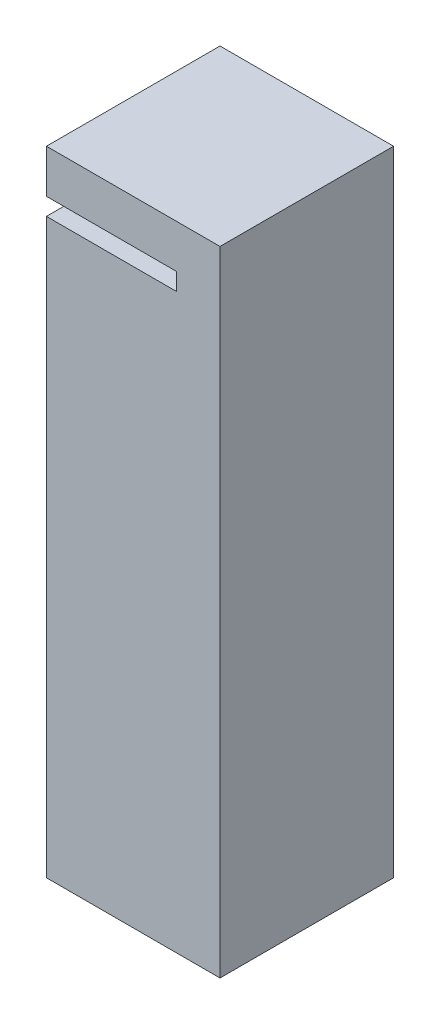
ISO-10303-21;
HEADER;
FILE_DESCRIPTION(('STEP AP214'),'2;1');
FILE_NAME('part.step','',(''),(''),'','','');
FILE_SCHEMA(('AUTOMOTIVE_DESIGN { 1 0 10303 214 1 1 1 1 }'));
ENDSEC;
DATA;
#1=APPLICATION_CONTEXT('core data for automotive mechanical design processes');
#2=APPLICATION_PROTOCOL_DEFINITION('international standard','automotive_design',2000,#1);
#3=PRODUCT_CONTEXT('',#1,'mechanical');
#4=PRODUCT('Part','Part','',(#3));
#5=PRODUCT_RELATED_PRODUCT_CATEGORY('part','',(#4));
#6=PRODUCT_DEFINITION_FORMATION('','',#4);
#7=PRODUCT_DEFINITION_CONTEXT('part definition',#1,'design');
#8=PRODUCT_DEFINITION('design','',#6,#7);
#9=PRODUCT_DEFINITION_SHAPE('','',#8);
#10=(LENGTH_UNIT() NAMED_UNIT(*) SI_UNIT(.MILLI.,.METRE.));
#11=(NAMED_UNIT(*) PLANE_ANGLE_UNIT() SI_UNIT($,.RADIAN.));
#12=(NAMED_UNIT(*) SI_UNIT($,.STERADIAN.) SOLID_ANGLE_UNIT());
#13=UNCERTAINTY_MEASURE_WITH_UNIT(LENGTH_MEASURE(1.E-05),#10,'distance_accuracy_value','');
#14=(GEOMETRIC_REPRESENTATION_CONTEXT(3) GLOBAL_UNCERTAINTY_ASSIGNED_CONTEXT((#13)) GLOBAL_UNIT_ASSIGNED_CONTEXT((#10,
#11,#12)) REPRESENTATION_CONTEXT('',''));
#15=CARTESIAN_POINT('',(0.,0.,0.));
#16=DIRECTION('',(0.,0.,1.));
#17=DIRECTION('',(1.,0.,0.));
#18=AXIS2_PLACEMENT_3D('',#15,#16,#17);
#19=CARTESIAN_POINT('',(0.,10.,0.));
#20=DIRECTION('',(1.,0.,0.));
#21=DIRECTION('',(0.,0.,-1.));
#22=AXIS2_PLACEMENT_3D('',#19,#20,#21);
#23=PLANE('',#22);
#24=DIRECTION('',(0.,0.,1.));
#25=VECTOR('',#24,1.);
#26=CARTESIAN_POINT('',(0.,136.,-31.6227766016838));
#27=LINE('',#26,#25);
#28=CARTESIAN_POINT('',(0.,136.,0.));
#29=VERTEX_POINT('',#28);
#30=CARTESIAN_POINT('',(0.,136.,40.));
#31=VERTEX_POINT('',#30);
#32=EDGE_CURVE('E179',#29,#31,#27,.T.);
#33=ORIENTED_EDGE('',*,*,#32,.T.);
#34=DIRECTION('',(0.,-1.,0.));
#35=VECTOR('',#34,1.);
#36=CARTESIAN_POINT('',(0.,10.,40.));
#37=LINE('',#36,#35);
#38=CARTESIAN_POINT('',(0.,146.,40.));
#39=VERTEX_POINT('',#38);
#40=EDGE_CURVE('E11',#39,#31,#37,.T.);
#41=ORIENTED_EDGE('',*,*,#40,.F.);
#42=DIRECTION('',(0.,0.,1.));
#43=VECTOR('',#42,1.);
#44=CARTESIAN_POINT('',(0.,146.,30.));
#45=LINE('',#44,#43);
#46=CARTESIAN_POINT('',(0.,146.,0.));
#47=VERTEX_POINT('',#46);
#48=EDGE_CURVE('E208',#47,#39,#45,.T.);
#49=ORIENTED_EDGE('',*,*,#48,.F.);
#50=DIRECTION('',(0.,-1.,0.));
#51=VECTOR('',#50,1.);
#52=CARTESIAN_POINT('',(0.,136.,0.));
#53=LINE('',#52,#51);
#54=EDGE_CURVE('E190',#47,#29,#53,.T.);
#55=ORIENTED_EDGE('',*,*,#54,.T.);
#56=EDGE_LOOP('',(#33,#41,#49,#55));
#57=FACE_BOUND('',#56,.T.);
#58=ADVANCED_FACE('F43',(#57),#23,.F.);
#59=CARTESIAN_POINT('',(30.,146.,0.));
#60=DIRECTION('',(1.,0.,0.));
#61=DIRECTION('',(0.,0.,-1.));
#62=AXIS2_PLACEMENT_3D('',#59,#60,#61);
#63=PLANE('',#62);
#64=DIRECTION('',(0.,0.,1.));
#65=VECTOR('',#64,1.);
#66=CARTESIAN_POINT('',(30.,132.,-31.6227766016838));
#67=LINE('',#66,#65);
#68=CARTESIAN_POINT('',(30.,132.,0.));
#69=VERTEX_POINT('',#68);
#70=CARTESIAN_POINT('',(30.,132.,40.));
#71=VERTEX_POINT('',#70);
#72=EDGE_CURVE('E132',#69,#71,#67,.T.);
#73=ORIENTED_EDGE('',*,*,#72,.T.);
#74=DIRECTION('',(0.,-1.,0.));
#75=VECTOR('',#74,1.);
#76=CARTESIAN_POINT('',(30.,136.,40.));
#77=LINE('',#76,#75);
#78=CARTESIAN_POINT('',(30.,136.,40.));
#79=VERTEX_POINT('',#78);
#80=EDGE_CURVE('E137',#79,#71,#77,.T.);
#81=ORIENTED_EDGE('',*,*,#80,.F.);
#82=DIRECTION('',(0.,0.,1.));
#83=VECTOR('',#82,1.);
#84=CARTESIAN_POINT('',(30.,136.,-31.6227766016838));
#85=LINE('',#84,#83);
#86=CARTESIAN_POINT('',(30.,136.,0.));
#87=VERTEX_POINT('',#86);
#88=EDGE_CURVE('E193',#87,#79,#85,.T.);
#89=ORIENTED_EDGE('',*,*,#88,.F.);
#90=DIRECTION('',(0.,-1.,0.));
#91=VECTOR('',#90,1.);
#92=CARTESIAN_POINT('',(30.,146.,0.));
#93=LINE('',#92,#91);
#94=EDGE_CURVE('E140',#87,#69,#93,.T.);
#95=ORIENTED_EDGE('',*,*,#94,.T.);
#96=EDGE_LOOP('',(#73,#81,#89,#95));
#97=FACE_BOUND('',#96,.T.);
#98=ADVANCED_FACE('F134',(#97),#63,.F.);
#99=DIRECTION('',(0.,0.,1.));
#100=VECTOR('',#99,1.);
#101=CARTESIAN_POINT('',(30.,122.,-31.6227766016838));
#102=LINE('',#101,#100);
#103=CARTESIAN_POINT('',(30.,122.,0.));
#104=VERTEX_POINT('',#103);
#105=CARTESIAN_POINT('',(30.,122.,30.));
#106=VERTEX_POINT('',#105);
#107=EDGE_CURVE('E167',#104,#106,#102,.T.);
#108=ORIENTED_EDGE('',*,*,#107,.F.);
#109=CARTESIAN_POINT('',(30.,10.,0.));
#110=VERTEX_POINT('',#109);
#111=EDGE_CURVE('E226',#104,#110,#93,.T.);
#112=ORIENTED_EDGE('',*,*,#111,.T.);
#113=DIRECTION('',(0.,0.,1.));
#114=VECTOR('',#113,1.);
#115=CARTESIAN_POINT('',(30.,10.,0.));
#116=LINE('',#115,#114);
#117=CARTESIAN_POINT('',(30.,10.,30.));
#118=VERTEX_POINT('',#117);
#119=EDGE_CURVE('E189',#110,#118,#116,.T.);
#120=ORIENTED_EDGE('',*,*,#119,.T.);
#121=DIRECTION('',(0.,-1.,0.));
#122=VECTOR('',#121,1.);
#123=CARTESIAN_POINT('',(30.,146.,30.));
#124=LINE('',#123,#122);
#125=EDGE_CURVE('E223',#106,#118,#124,.T.);
#126=ORIENTED_EDGE('',*,*,#125,.F.);
#127=EDGE_LOOP('',(#108,#112,#120,#126));
#128=FACE_BOUND('',#127,.T.);
#129=ADVANCED_FACE('F289',(#128),#63,.F.);
#130=CARTESIAN_POINT('',(30.,146.,30.));
#131=DIRECTION('',(0.,0.,1.));
#132=DIRECTION('',(1.,0.,0.));
#133=AXIS2_PLACEMENT_3D('',#130,#131,#132);
#134=PLANE('',#133);
#135=DIRECTION('',(-1.,0.,0.));
#136=VECTOR('',#135,1.);
#137=CARTESIAN_POINT('',(0.,122.,30.));
#138=LINE('',#137,#136);
#139=CARTESIAN_POINT('',(0.,122.,30.));
#140=VERTEX_POINT('',#139);
#141=EDGE_CURVE('E59',#106,#140,#138,.T.);
#142=ORIENTED_EDGE('',*,*,#141,.F.);
#143=ORIENTED_EDGE('',*,*,#125,.T.);
#144=DIRECTION('',(-1.,0.,0.));
#145=VECTOR('',#144,1.);
#146=CARTESIAN_POINT('',(30.,10.,30.));
#147=LINE('',#146,#145);
#148=CARTESIAN_POINT('',(0.,10.,30.));
#149=VERTEX_POINT('',#148);
#150=EDGE_CURVE('E204',#118,#149,#147,.T.);
#151=ORIENTED_EDGE('',*,*,#150,.T.);
#152=DIRECTION('',(0.,-1.,0.));
#153=VECTOR('',#152,1.);
#154=CARTESIAN_POINT('',(0.,146.,30.));
#155=LINE('',#154,#153);
#156=EDGE_CURVE('E64',#140,#149,#155,.T.);
#157=ORIENTED_EDGE('',*,*,#156,.F.);
#158=EDGE_LOOP('',(#142,#143,#151,#157));
#159=FACE_BOUND('',#158,.T.);
#160=ADVANCED_FACE('F292',(#159),#134,.F.);
#161=CARTESIAN_POINT('',(0.,132.,40.));
#162=VERTEX_POINT('',#161);
#163=CARTESIAN_POINT('',(0.,0.,40.));
#164=VERTEX_POINT('',#163);
#165=EDGE_CURVE('E52',#162,#164,#37,.T.);
#166=ORIENTED_EDGE('',*,*,#165,.F.);
#167=DIRECTION('',(0.,0.,1.));
#168=VECTOR('',#167,1.);
#169=CARTESIAN_POINT('',(0.,132.,-31.6227766016838));
#170=LINE('',#169,#168);
#171=CARTESIAN_POINT('',(0.,132.,0.));
#172=VERTEX_POINT('',#171);
#173=EDGE_CURVE('E145',#172,#162,#170,.T.);
#174=ORIENTED_EDGE('',*,*,#173,.F.);
#175=DIRECTION('',(0.,-1.,0.));
#176=VECTOR('',#175,1.);
#177=CARTESIAN_POINT('',(0.,132.,0.));
#178=LINE('',#177,#176);
#179=CARTESIAN_POINT('',(0.,122.,0.));
#180=VERTEX_POINT('',#179);
#181=EDGE_CURVE('E168',#172,#180,#178,.T.);
#182=ORIENTED_EDGE('',*,*,#181,.T.);
#183=DIRECTION('',(0.,0.,1.));
#184=VECTOR('',#183,1.);
#185=CARTESIAN_POINT('',(0.,122.,-31.6227766016838));
#186=LINE('',#185,#184);
#187=EDGE_CURVE('E172',#180,#140,#186,.T.);
#188=ORIENTED_EDGE('',*,*,#187,.T.);
#189=ORIENTED_EDGE('',*,*,#156,.T.);
#190=DIRECTION('',(0.,0.,1.));
#191=VECTOR('',#190,1.);
#192=CARTESIAN_POINT('',(0.,10.,0.));
#193=LINE('',#192,#191);
#194=CARTESIAN_POINT('',(0.,10.,0.));
#195=VERTEX_POINT('',#194);
#196=EDGE_CURVE('E230',#195,#149,#193,.T.);
#197=ORIENTED_EDGE('',*,*,#196,.F.);
#198=DIRECTION('',(0.,-1.,0.));
#199=VECTOR('',#198,1.);
#200=CARTESIAN_POINT('',(0.,10.,0.));
#201=LINE('',#200,#199);
#202=CARTESIAN_POINT('',(0.,0.,0.));
#203=VERTEX_POINT('',#202);
#204=EDGE_CURVE('E238',#195,#203,#201,.T.);
#205=ORIENTED_EDGE('',*,*,#204,.T.);
#206=DIRECTION('',(0.,0.,1.));
#207=VECTOR('',#206,1.);
#208=CARTESIAN_POINT('',(0.,0.,0.));
#209=LINE('',#208,#207);
#210=EDGE_CURVE('E229',#203,#164,#209,.T.);
#211=ORIENTED_EDGE('',*,*,#210,.T.);
#212=EDGE_LOOP('',(#166,#174,#182,#188,#189,#197,#205,#211));
#213=FACE_BOUND('',#212,.T.);
#214=ADVANCED_FACE('F45',(#213),#23,.F.);
#215=CARTESIAN_POINT('',(0.,10.,40.));
#216=DIRECTION('',(0.,0.,-1.));
#217=DIRECTION('',(-1.,0.,0.));
#218=AXIS2_PLACEMENT_3D('',#215,#216,#217);
#219=PLANE('',#218);
#220=ORIENTED_EDGE('',*,*,#40,.T.);
#221=DIRECTION('',(1.,0.,0.));
#222=VECTOR('',#221,1.);
#223=CARTESIAN_POINT('',(30.,136.,40.));
#224=LINE('',#223,#222);
#225=EDGE_CURVE('E154',#31,#79,#224,.T.);
#226=ORIENTED_EDGE('',*,*,#225,.T.);
#227=ORIENTED_EDGE('',*,*,#80,.T.);
#228=DIRECTION('',(-1.,0.,0.));
#229=VECTOR('',#228,1.);
#230=CARTESIAN_POINT('',(30.,132.,40.));
#231=LINE('',#230,#229);
#232=EDGE_CURVE('E148',#71,#162,#231,.T.);
#233=ORIENTED_EDGE('',*,*,#232,.T.);
#234=ORIENTED_EDGE('',*,*,#165,.T.);
#235=DIRECTION('',(1.,0.,0.));
#236=VECTOR('',#235,1.);
#237=CARTESIAN_POINT('',(0.,0.,40.));
#238=LINE('',#237,#236);
#239=CARTESIAN_POINT('',(40.,0.,40.));
#240=VERTEX_POINT('',#239);
#241=EDGE_CURVE('E242',#164,#240,#238,.T.);
#242=ORIENTED_EDGE('',*,*,#241,.T.);
#243=DIRECTION('',(0.,-1.,0.));
#244=VECTOR('',#243,1.);
#245=CARTESIAN_POINT('',(40.,10.,40.));
#246=LINE('',#245,#244);
#247=CARTESIAN_POINT('',(40.,146.,40.));
#248=VERTEX_POINT('',#247);
#249=EDGE_CURVE('E256',#248,#240,#246,.T.);
#250=ORIENTED_EDGE('',*,*,#249,.F.);
#251=DIRECTION('',(1.,0.,0.));
#252=VECTOR('',#251,1.);
#253=CARTESIAN_POINT('',(0.,146.,40.));
#254=LINE('',#253,#252);
#255=EDGE_CURVE('E212',#39,#248,#254,.T.);
#256=ORIENTED_EDGE('',*,*,#255,.F.);
#257=EDGE_LOOP('',(#220,#226,#227,#233,#234,#242,#250,#256));
#258=FACE_BOUND('',#257,.T.);
#259=ADVANCED_FACE('F156',(#258),#219,.F.);
#260=CARTESIAN_POINT('',(40.,10.,0.));
#261=DIRECTION('',(-1.,0.,0.));
#262=DIRECTION('',(0.,0.,1.));
#263=AXIS2_PLACEMENT_3D('',#260,#261,#262);
#264=PLANE('',#263);
#265=DIRECTION('',(0.,0.,-1.));
#266=VECTOR('',#265,1.);
#267=CARTESIAN_POINT('',(40.,0.,0.));
#268=LINE('',#267,#266);
#269=CARTESIAN_POINT('',(40.,0.,0.));
#270=VERTEX_POINT('',#269);
#271=EDGE_CURVE('E245',#240,#270,#268,.T.);
#272=ORIENTED_EDGE('',*,*,#271,.T.);
#273=DIRECTION('',(0.,-1.,0.));
#274=VECTOR('',#273,1.);
#275=CARTESIAN_POINT('',(40.,10.,0.));
#276=LINE('',#275,#274);
#277=CARTESIAN_POINT('',(40.,146.,0.));
#278=VERTEX_POINT('',#277);
#279=EDGE_CURVE('E253',#278,#270,#276,.T.);
#280=ORIENTED_EDGE('',*,*,#279,.F.);
#281=DIRECTION('',(0.,0.,-1.));
#282=VECTOR('',#281,1.);
#283=CARTESIAN_POINT('',(40.,146.,40.));
#284=LINE('',#283,#282);
#285=EDGE_CURVE('E199',#248,#278,#284,.T.);
#286=ORIENTED_EDGE('',*,*,#285,.F.);
#287=ORIENTED_EDGE('',*,*,#249,.T.);
#288=EDGE_LOOP('',(#272,#280,#286,#287));
#289=FACE_BOUND('',#288,.T.);
#290=ADVANCED_FACE('F276',(#289),#264,.F.);
#291=CARTESIAN_POINT('',(0.,10.,0.));
#292=DIRECTION('',(0.,0.,1.));
#293=DIRECTION('',(1.,0.,0.));
#294=AXIS2_PLACEMENT_3D('',#291,#292,#293);
#295=PLANE('',#294);
#296=DIRECTION('',(-1.,0.,0.));
#297=VECTOR('',#296,1.);
#298=CARTESIAN_POINT('',(0.,0.,0.));
#299=LINE('',#298,#297);
#300=EDGE_CURVE('E235',#270,#203,#299,.T.);
#301=ORIENTED_EDGE('',*,*,#300,.T.);
#302=ORIENTED_EDGE('',*,*,#204,.F.);
#303=DIRECTION('',(-1.,0.,0.));
#304=VECTOR('',#303,1.);
#305=CARTESIAN_POINT('',(0.,10.,0.));
#306=LINE('',#305,#304);
#307=EDGE_CURVE('E234',#110,#195,#306,.T.);
#308=ORIENTED_EDGE('',*,*,#307,.F.);
#309=ORIENTED_EDGE('',*,*,#111,.F.);
#310=DIRECTION('',(1.,0.,0.));
#311=VECTOR('',#310,1.);
#312=CARTESIAN_POINT('',(0.,122.,0.));
#313=LINE('',#312,#311);
#314=EDGE_CURVE('E163',#180,#104,#313,.T.);
#315=ORIENTED_EDGE('',*,*,#314,.F.);
#316=ORIENTED_EDGE('',*,*,#181,.F.);
#317=DIRECTION('',(-1.,0.,0.));
#318=VECTOR('',#317,1.);
#319=CARTESIAN_POINT('',(30.,132.,0.));
#320=LINE('',#319,#318);
#321=EDGE_CURVE('E164',#69,#172,#320,.T.);
#322=ORIENTED_EDGE('',*,*,#321,.F.);
#323=ORIENTED_EDGE('',*,*,#94,.F.);
#324=DIRECTION('',(1.,0.,0.));
#325=VECTOR('',#324,1.);
#326=CARTESIAN_POINT('',(30.,136.,0.));
#327=LINE('',#326,#325);
#328=EDGE_CURVE('E186',#29,#87,#327,.T.);
#329=ORIENTED_EDGE('',*,*,#328,.F.);
#330=ORIENTED_EDGE('',*,*,#54,.F.);
#331=DIRECTION('',(-1.,0.,0.));
#332=VECTOR('',#331,1.);
#333=CARTESIAN_POINT('',(40.,146.,0.));
#334=LINE('',#333,#332);
#335=EDGE_CURVE('E203',#278,#47,#334,.T.);
#336=ORIENTED_EDGE('',*,*,#335,.F.);
#337=ORIENTED_EDGE('',*,*,#279,.T.);
#338=EDGE_LOOP('',(#301,#302,#308,#309,#315,#316,#322,#323,#329,#330,#336,#337));
#339=FACE_BOUND('',#338,.T.);
#340=ADVANCED_FACE('F273',(#339),#295,.F.);
#341=CARTESIAN_POINT('',(0.,10.,0.));
#342=DIRECTION('',(0.,1.,0.));
#343=DIRECTION('',(0.,0.,1.));
#344=AXIS2_PLACEMENT_3D('',#341,#342,#343);
#345=PLANE('',#344);
#346=ORIENTED_EDGE('',*,*,#150,.F.);
#347=ORIENTED_EDGE('',*,*,#119,.F.);
#348=ORIENTED_EDGE('',*,*,#307,.T.);
#349=ORIENTED_EDGE('',*,*,#196,.T.);
#350=EDGE_LOOP('',(#346,#347,#348,#349));
#351=FACE_BOUND('',#350,.T.);
#352=ADVANCED_FACE('F294',(#351),#345,.T.);
#353=CARTESIAN_POINT('',(0.,0.,0.));
#354=DIRECTION('',(0.,1.,0.));
#355=DIRECTION('',(0.,0.,1.));
#356=AXIS2_PLACEMENT_3D('',#353,#354,#355);
#357=PLANE('',#356);
#358=ORIENTED_EDGE('',*,*,#210,.F.);
#359=ORIENTED_EDGE('',*,*,#300,.F.);
#360=ORIENTED_EDGE('',*,*,#271,.F.);
#361=ORIENTED_EDGE('',*,*,#241,.F.);
#362=EDGE_LOOP('',(#358,#359,#360,#361));
#363=FACE_BOUND('',#362,.T.);
#364=ADVANCED_FACE('F267',(#363),#357,.F.);
#365=CARTESIAN_POINT('',(0.,146.,0.));
#366=DIRECTION('',(0.,1.,0.));
#367=DIRECTION('',(0.,0.,1.));
#368=AXIS2_PLACEMENT_3D('',#365,#366,#367);
#369=PLANE('',#368);
#370=ORIENTED_EDGE('',*,*,#335,.T.);
#371=ORIENTED_EDGE('',*,*,#48,.T.);
#372=ORIENTED_EDGE('',*,*,#255,.T.);
#373=ORIENTED_EDGE('',*,*,#285,.T.);
#374=EDGE_LOOP('',(#370,#371,#372,#373));
#375=FACE_BOUND('',#374,.T.);
#376=ADVANCED_FACE('F278',(#375),#369,.T.);
#377=CARTESIAN_POINT('',(30.,136.,-31.6227766016838));
#378=DIRECTION('',(0.,1.,0.));
#379=DIRECTION('',(0.,0.,1.));
#380=AXIS2_PLACEMENT_3D('',#377,#378,#379);
#381=PLANE('',#380);
#382=ORIENTED_EDGE('',*,*,#32,.F.);
#383=ORIENTED_EDGE('',*,*,#328,.T.);
#384=ORIENTED_EDGE('',*,*,#88,.T.);
#385=ORIENTED_EDGE('',*,*,#225,.F.);
#386=EDGE_LOOP('',(#382,#383,#384,#385));
#387=FACE_BOUND('',#386,.T.);
#388=ADVANCED_FACE('F283',(#387),#381,.F.);
#389=CARTESIAN_POINT('',(30.,132.,-31.6227766016838));
#390=DIRECTION('',(0.,-1.,0.));
#391=DIRECTION('',(0.,0.,-1.));
#392=AXIS2_PLACEMENT_3D('',#389,#390,#391);
#393=PLANE('',#392);
#394=ORIENTED_EDGE('',*,*,#72,.F.);
#395=ORIENTED_EDGE('',*,*,#321,.T.);
#396=ORIENTED_EDGE('',*,*,#173,.T.);
#397=ORIENTED_EDGE('',*,*,#232,.F.);
#398=EDGE_LOOP('',(#394,#395,#396,#397));
#399=FACE_BOUND('',#398,.T.);
#400=ADVANCED_FACE('F149',(#399),#393,.F.);
#401=CARTESIAN_POINT('',(0.,122.,-31.6227766016838));
#402=DIRECTION('',(0.,1.,0.));
#403=DIRECTION('',(0.,0.,1.));
#404=AXIS2_PLACEMENT_3D('',#401,#402,#403);
#405=PLANE('',#404);
#406=ORIENTED_EDGE('',*,*,#187,.F.);
#407=ORIENTED_EDGE('',*,*,#314,.T.);
#408=ORIENTED_EDGE('',*,*,#107,.T.);
#409=ORIENTED_EDGE('',*,*,#141,.T.);
#410=EDGE_LOOP('',(#406,#407,#408,#409));
#411=FACE_BOUND('',#410,.T.);
#412=ADVANCED_FACE('F286',(#411),#405,.F.);
#413=CLOSED_SHELL('',(#58,#98,#129,#160,#214,#259,#290,#340,#352,#364,#376,#388,#400,#412));
#414=MANIFOLD_SOLID_BREP('B2',#413);
#415=ADVANCED_BREP_SHAPE_REPRESENTATION('',(#18,#414),#14);
#416=SHAPE_DEFINITION_REPRESENTATION(#9,#415);
ENDSEC;
END-ISO-10303-21;
